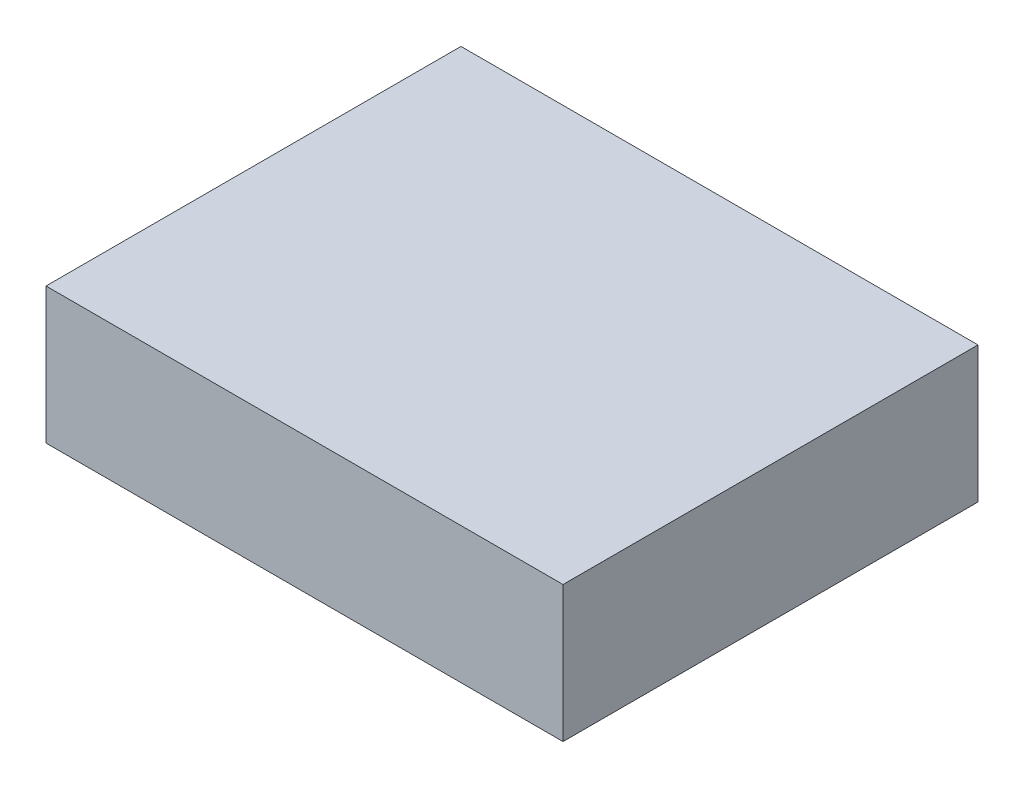
ISO-10303-21;
HEADER;
FILE_DESCRIPTION(('STEP AP214'),'2;1');
FILE_NAME('part.step','',(''),(''),'','','');
FILE_SCHEMA(('AUTOMOTIVE_DESIGN { 1 0 10303 214 1 1 1 1 }'));
ENDSEC;
DATA;
#1=APPLICATION_CONTEXT('core data for automotive mechanical design processes');
#2=APPLICATION_PROTOCOL_DEFINITION('international standard','automotive_design',2000,#1);
#3=PRODUCT_CONTEXT('',#1,'mechanical');
#4=PRODUCT('Part','Part','',(#3));
#5=PRODUCT_RELATED_PRODUCT_CATEGORY('part','',(#4));
#6=PRODUCT_DEFINITION_FORMATION('','',#4);
#7=PRODUCT_DEFINITION_CONTEXT('part definition',#1,'design');
#8=PRODUCT_DEFINITION('design','',#6,#7);
#9=PRODUCT_DEFINITION_SHAPE('','',#8);
#10=(LENGTH_UNIT() NAMED_UNIT(*) SI_UNIT(.MILLI.,.METRE.));
#11=(NAMED_UNIT(*) PLANE_ANGLE_UNIT() SI_UNIT($,.RADIAN.));
#12=(NAMED_UNIT(*) SI_UNIT($,.STERADIAN.) SOLID_ANGLE_UNIT());
#13=UNCERTAINTY_MEASURE_WITH_UNIT(LENGTH_MEASURE(1.E-05),#10,'distance_accuracy_value','');
#14=(GEOMETRIC_REPRESENTATION_CONTEXT(3) GLOBAL_UNCERTAINTY_ASSIGNED_CONTEXT((#13)) GLOBAL_UNIT_ASSIGNED_CONTEXT((#10,
#11,#12)) REPRESENTATION_CONTEXT('',''));
#15=CARTESIAN_POINT('',(0.,0.,0.));
#16=DIRECTION('',(0.,0.,1.));
#17=DIRECTION('',(1.,0.,0.));
#18=AXIS2_PLACEMENT_3D('',#15,#16,#17);
#19=CARTESIAN_POINT('',(-28.7292225201072,20.,-15.230563002681));
#20=DIRECTION('',(1.,0.,0.));
#21=DIRECTION('',(0.,0.,-1.));
#22=AXIS2_PLACEMENT_3D('',#19,#20,#21);
#23=PLANE('',#22);
#24=DIRECTION('',(0.,0.,1.));
#25=VECTOR('',#24,1.);
#26=CARTESIAN_POINT('',(-28.7292225201072,0.,-15.230563002681));
#27=LINE('',#26,#25);
#28=CARTESIAN_POINT('',(-28.7292225201072,0.,-15.230563002681));
#29=VERTEX_POINT('',#28);
#30=CARTESIAN_POINT('',(-28.7292225201072,0.,45.769436997319));
#31=VERTEX_POINT('',#30);
#32=EDGE_CURVE('E100',#29,#31,#27,.T.);
#33=ORIENTED_EDGE('',*,*,#32,.T.);
#34=DIRECTION('',(0.,-1.,0.));
#35=VECTOR('',#34,1.);
#36=CARTESIAN_POINT('',(-28.7292225201072,20.,45.769436997319));
#37=LINE('',#36,#35);
#38=CARTESIAN_POINT('',(-28.7292225201072,20.,45.769436997319));
#39=VERTEX_POINT('',#38);
#40=EDGE_CURVE('E11',#39,#31,#37,.T.);
#41=ORIENTED_EDGE('',*,*,#40,.F.);
#42=DIRECTION('',(0.,0.,1.));
#43=VECTOR('',#42,1.);
#44=CARTESIAN_POINT('',(-28.7292225201072,20.,-15.230563002681));
#45=LINE('',#44,#43);
#46=CARTESIAN_POINT('',(-28.7292225201072,20.,-15.230563002681));
#47=VERTEX_POINT('',#46);
#48=EDGE_CURVE('E88',#47,#39,#45,.T.);
#49=ORIENTED_EDGE('',*,*,#48,.F.);
#50=DIRECTION('',(0.,-1.,0.));
#51=VECTOR('',#50,1.);
#52=CARTESIAN_POINT('',(-28.7292225201072,20.,-15.230563002681));
#53=LINE('',#52,#51);
#54=EDGE_CURVE('E96',#47,#29,#53,.T.);
#55=ORIENTED_EDGE('',*,*,#54,.T.);
#56=EDGE_LOOP('',(#33,#41,#49,#55));
#57=FACE_BOUND('',#56,.T.);
#58=ADVANCED_FACE('F37',(#57),#23,.F.);
#59=CARTESIAN_POINT('',(-28.7292225201072,20.,45.769436997319));
#60=DIRECTION('',(0.,0.,-1.));
#61=DIRECTION('',(-1.,0.,0.));
#62=AXIS2_PLACEMENT_3D('',#59,#60,#61);
#63=PLANE('',#62);
#64=DIRECTION('',(1.,0.,0.));
#65=VECTOR('',#64,1.);
#66=CARTESIAN_POINT('',(-28.7292225201072,0.,45.769436997319));
#67=LINE('',#66,#65);
#68=CARTESIAN_POINT('',(47.2707774798928,0.,45.769436997319));
#69=VERTEX_POINT('',#68);
#70=EDGE_CURVE('E92',#31,#69,#67,.T.);
#71=ORIENTED_EDGE('',*,*,#70,.T.);
#72=DIRECTION('',(0.,-1.,0.));
#73=VECTOR('',#72,1.);
#74=CARTESIAN_POINT('',(47.2707774798928,20.,45.769436997319));
#75=LINE('',#74,#73);
#76=CARTESIAN_POINT('',(47.2707774798928,20.,45.769436997319));
#77=VERTEX_POINT('',#76);
#78=EDGE_CURVE('E45',#77,#69,#75,.T.);
#79=ORIENTED_EDGE('',*,*,#78,.F.);
#80=DIRECTION('',(1.,0.,0.));
#81=VECTOR('',#80,1.);
#82=CARTESIAN_POINT('',(-28.7292225201072,20.,45.769436997319));
#83=LINE('',#82,#81);
#84=EDGE_CURVE('E83',#39,#77,#83,.T.);
#85=ORIENTED_EDGE('',*,*,#84,.F.);
#86=ORIENTED_EDGE('',*,*,#40,.T.);
#87=EDGE_LOOP('',(#71,#79,#85,#86));
#88=FACE_BOUND('',#87,.T.);
#89=ADVANCED_FACE('F91',(#88),#63,.F.);
#90=CARTESIAN_POINT('',(47.2707774798928,20.,-15.230563002681));
#91=DIRECTION('',(-1.,0.,0.));
#92=DIRECTION('',(0.,0.,1.));
#93=AXIS2_PLACEMENT_3D('',#90,#91,#92);
#94=PLANE('',#93);
#95=DIRECTION('',(0.,0.,-1.));
#96=VECTOR('',#95,1.);
#97=CARTESIAN_POINT('',(47.2707774798928,0.,-15.230563002681));
#98=LINE('',#97,#96);
#99=CARTESIAN_POINT('',(47.2707774798928,0.,-15.230563002681));
#100=VERTEX_POINT('',#99);
#101=EDGE_CURVE('E70',#69,#100,#98,.T.);
#102=ORIENTED_EDGE('',*,*,#101,.T.);
#103=DIRECTION('',(0.,-1.,0.));
#104=VECTOR('',#103,1.);
#105=CARTESIAN_POINT('',(47.2707774798928,20.,-15.230563002681));
#106=LINE('',#105,#104);
#107=CARTESIAN_POINT('',(47.2707774798928,20.,-15.230563002681));
#108=VERTEX_POINT('',#107);
#109=EDGE_CURVE('E93',#108,#100,#106,.T.);
#110=ORIENTED_EDGE('',*,*,#109,.F.);
#111=DIRECTION('',(0.,0.,-1.));
#112=VECTOR('',#111,1.);
#113=CARTESIAN_POINT('',(47.2707774798928,20.,-15.230563002681));
#114=LINE('',#113,#112);
#115=EDGE_CURVE('E86',#77,#108,#114,.T.);
#116=ORIENTED_EDGE('',*,*,#115,.F.);
#117=ORIENTED_EDGE('',*,*,#78,.T.);
#118=EDGE_LOOP('',(#102,#110,#116,#117));
#119=FACE_BOUND('',#118,.T.);
#120=ADVANCED_FACE('F94',(#119),#94,.F.);
#121=CARTESIAN_POINT('',(-28.7292225201072,20.,-15.230563002681));
#122=DIRECTION('',(0.,0.,1.));
#123=DIRECTION('',(1.,0.,0.));
#124=AXIS2_PLACEMENT_3D('',#121,#122,#123);
#125=PLANE('',#124);
#126=DIRECTION('',(-1.,0.,0.));
#127=VECTOR('',#126,1.);
#128=CARTESIAN_POINT('',(-28.7292225201072,0.,-15.230563002681));
#129=LINE('',#128,#127);
#130=EDGE_CURVE('E76',#100,#29,#129,.T.);
#131=ORIENTED_EDGE('',*,*,#130,.T.);
#132=ORIENTED_EDGE('',*,*,#54,.F.);
#133=DIRECTION('',(-1.,0.,0.));
#134=VECTOR('',#133,1.);
#135=CARTESIAN_POINT('',(-28.7292225201072,20.,-15.230563002681));
#136=LINE('',#135,#134);
#137=EDGE_CURVE('E53',#108,#47,#136,.T.);
#138=ORIENTED_EDGE('',*,*,#137,.F.);
#139=ORIENTED_EDGE('',*,*,#109,.T.);
#140=EDGE_LOOP('',(#131,#132,#138,#139));
#141=FACE_BOUND('',#140,.T.);
#142=ADVANCED_FACE('F107',(#141),#125,.F.);
#143=CARTESIAN_POINT('',(0.,20.,0.));
#144=DIRECTION('',(0.,1.,0.));
#145=DIRECTION('',(0.,0.,1.));
#146=AXIS2_PLACEMENT_3D('',#143,#144,#145);
#147=PLANE('',#146);
#148=ORIENTED_EDGE('',*,*,#48,.T.);
#149=ORIENTED_EDGE('',*,*,#84,.T.);
#150=ORIENTED_EDGE('',*,*,#115,.T.);
#151=ORIENTED_EDGE('',*,*,#137,.T.);
#152=EDGE_LOOP('',(#148,#149,#150,#151));
#153=FACE_BOUND('',#152,.T.);
#154=ADVANCED_FACE('F84',(#153),#147,.T.);
#155=CARTESIAN_POINT('',(0.,0.,0.));
#156=DIRECTION('',(0.,1.,0.));
#157=DIRECTION('',(0.,0.,1.));
#158=AXIS2_PLACEMENT_3D('',#155,#156,#157);
#159=PLANE('',#158);
#160=ORIENTED_EDGE('',*,*,#32,.F.);
#161=ORIENTED_EDGE('',*,*,#130,.F.);
#162=ORIENTED_EDGE('',*,*,#101,.F.);
#163=ORIENTED_EDGE('',*,*,#70,.F.);
#164=EDGE_LOOP('',(#160,#161,#162,#163));
#165=FACE_BOUND('',#164,.T.);
#166=ADVANCED_FACE('F110',(#165),#159,.F.);
#167=CLOSED_SHELL('',(#58,#89,#120,#142,#154,#166));
#168=MANIFOLD_SOLID_BREP('B2',#167);
#169=ADVANCED_BREP_SHAPE_REPRESENTATION('',(#18,#168),#14);
#170=SHAPE_DEFINITION_REPRESENTATION(#9,#169);
ENDSEC;
END-ISO-10303-21;
